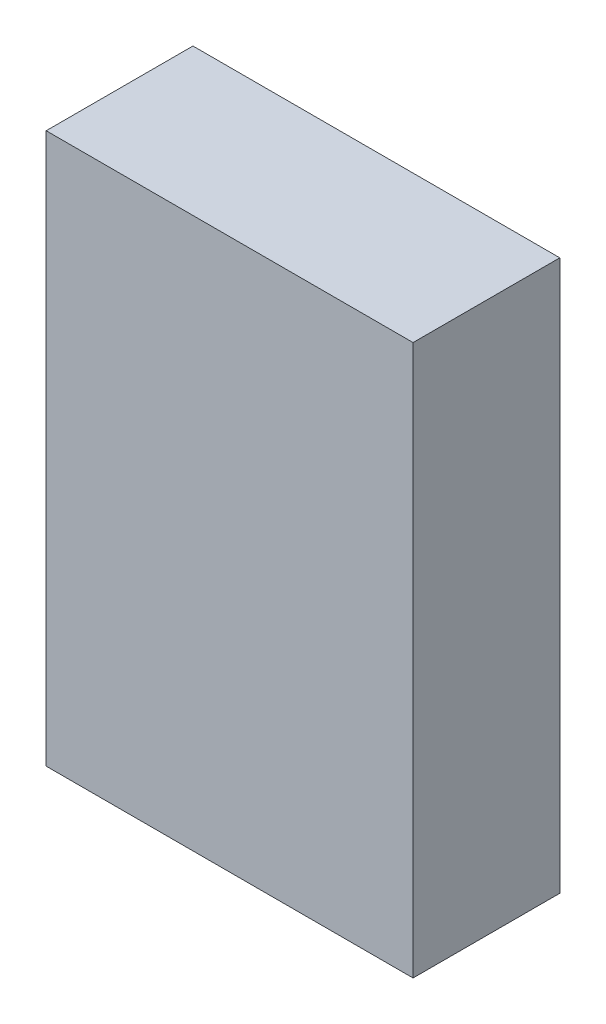
ISO-10303-21;
HEADER;
FILE_DESCRIPTION(('STEP AP214'),'2;1');
FILE_NAME('part.step','',(''),(''),'','','');
FILE_SCHEMA(('AUTOMOTIVE_DESIGN { 1 0 10303 214 1 1 1 1 }'));
ENDSEC;
DATA;
#1=APPLICATION_CONTEXT('core data for automotive mechanical design processes');
#2=APPLICATION_PROTOCOL_DEFINITION('international standard','automotive_design',2000,#1);
#3=PRODUCT_CONTEXT('',#1,'mechanical');
#4=PRODUCT('Part','Part','',(#3));
#5=PRODUCT_RELATED_PRODUCT_CATEGORY('part','',(#4));
#6=PRODUCT_DEFINITION_FORMATION('','',#4);
#7=PRODUCT_DEFINITION_CONTEXT('part definition',#1,'design');
#8=PRODUCT_DEFINITION('design','',#6,#7);
#9=PRODUCT_DEFINITION_SHAPE('','',#8);
#10=(LENGTH_UNIT() NAMED_UNIT(*) SI_UNIT(.MILLI.,.METRE.));
#11=(NAMED_UNIT(*) PLANE_ANGLE_UNIT() SI_UNIT($,.RADIAN.));
#12=(NAMED_UNIT(*) SI_UNIT($,.STERADIAN.) SOLID_ANGLE_UNIT());
#13=UNCERTAINTY_MEASURE_WITH_UNIT(LENGTH_MEASURE(1.E-05),#10,'distance_accuracy_value','');
#14=(GEOMETRIC_REPRESENTATION_CONTEXT(3) GLOBAL_UNCERTAINTY_ASSIGNED_CONTEXT((#13)) GLOBAL_UNIT_ASSIGNED_CONTEXT((#10,
#11,#12)) REPRESENTATION_CONTEXT('',''));
#15=CARTESIAN_POINT('',(0.,0.,0.));
#16=DIRECTION('',(0.,0.,1.));
#17=DIRECTION('',(1.,0.,0.));
#18=AXIS2_PLACEMENT_3D('',#15,#16,#17);
#19=CARTESIAN_POINT('',(-56.6260359487677,165.288343558282,80.));
#20=DIRECTION('',(1.,0.,0.));
#21=DIRECTION('',(0.,1.,0.));
#22=AXIS2_PLACEMENT_3D('',#19,#20,#21);
#23=PLANE('',#22);
#24=DIRECTION('',(0.,-1.,0.));
#25=VECTOR('',#24,1.);
#26=CARTESIAN_POINT('',(-56.6260359487677,165.288343558282,0.));
#27=LINE('',#26,#25);
#28=CARTESIAN_POINT('',(-56.6260359487677,165.288343558282,0.));
#29=VERTEX_POINT('',#28);
#30=CARTESIAN_POINT('',(-56.6260359487677,-134.711656441718,0.));
#31=VERTEX_POINT('',#30);
#32=EDGE_CURVE('E177',#29,#31,#27,.T.);
#33=ORIENTED_EDGE('',*,*,#32,.T.);
#34=DIRECTION('',(0.,0.,-1.));
#35=VECTOR('',#34,1.);
#36=CARTESIAN_POINT('',(-56.6260359487677,-134.711656441718,80.));
#37=LINE('',#36,#35);
#38=CARTESIAN_POINT('',(-56.6260359487677,-134.711656441718,80.));
#39=VERTEX_POINT('',#38);
#40=EDGE_CURVE('E221',#39,#31,#37,.T.);
#41=ORIENTED_EDGE('',*,*,#40,.F.);
#42=DIRECTION('',(0.,-1.,0.));
#43=VECTOR('',#42,1.);
#44=CARTESIAN_POINT('',(-56.6260359487677,165.288343558282,80.));
#45=LINE('',#44,#43);
#46=CARTESIAN_POINT('',(-56.6260359487677,165.288343558282,80.));
#47=VERTEX_POINT('',#46);
#48=EDGE_CURVE('E195',#47,#39,#45,.T.);
#49=ORIENTED_EDGE('',*,*,#48,.F.);
#50=DIRECTION('',(0.,0.,-1.));
#51=VECTOR('',#50,1.);
#52=CARTESIAN_POINT('',(-56.6260359487677,165.288343558282,80.));
#53=LINE('',#52,#51);
#54=EDGE_CURVE('E205',#47,#29,#53,.T.);
#55=ORIENTED_EDGE('',*,*,#54,.T.);
#56=EDGE_LOOP('',(#33,#41,#49,#55));
#57=FACE_BOUND('',#56,.T.);
#58=ADVANCED_FACE('F37',(#57),#23,.F.);
#59=CARTESIAN_POINT('',(-56.6260359487677,-134.711656441718,80.));
#60=DIRECTION('',(0.,1.,0.));
#61=DIRECTION('',(0.,0.,1.));
#62=AXIS2_PLACEMENT_3D('',#59,#60,#61);
#63=PLANE('',#62);
#64=DIRECTION('',(1.,0.,0.));
#65=VECTOR('',#64,1.);
#66=CARTESIAN_POINT('',(-56.6260359487677,-134.711656441718,0.));
#67=LINE('',#66,#65);
#68=CARTESIAN_POINT('',(143.373964051232,-134.711656441718,0.));
#69=VERTEX_POINT('',#68);
#70=EDGE_CURVE('E208',#31,#69,#67,.T.);
#71=ORIENTED_EDGE('',*,*,#70,.T.);
#72=DIRECTION('',(0.,0.,-1.));
#73=VECTOR('',#72,1.);
#74=CARTESIAN_POINT('',(143.373964051232,-134.711656441718,80.));
#75=LINE('',#74,#73);
#76=CARTESIAN_POINT('',(143.373964051232,-134.711656441718,80.));
#77=VERTEX_POINT('',#76);
#78=EDGE_CURVE('E218',#77,#69,#75,.T.);
#79=ORIENTED_EDGE('',*,*,#78,.F.);
#80=DIRECTION('',(1.,0.,0.));
#81=VECTOR('',#80,1.);
#82=CARTESIAN_POINT('',(-56.6260359487677,-134.711656441718,80.));
#83=LINE('',#82,#81);
#84=EDGE_CURVE('E198',#39,#77,#83,.T.);
#85=ORIENTED_EDGE('',*,*,#84,.F.);
#86=ORIENTED_EDGE('',*,*,#40,.T.);
#87=EDGE_LOOP('',(#71,#79,#85,#86));
#88=FACE_BOUND('',#87,.T.);
#89=ADVANCED_FACE('F287',(#88),#63,.F.);
#90=CARTESIAN_POINT('',(143.373964051232,165.288343558282,80.));
#91=DIRECTION('',(-1.,0.,0.));
#92=DIRECTION('',(0.,-1.,0.));
#93=AXIS2_PLACEMENT_3D('',#90,#91,#92);
#94=PLANE('',#93);
#95=DIRECTION('',(0.,1.,0.));
#96=VECTOR('',#95,1.);
#97=CARTESIAN_POINT('',(143.373964051232,165.288343558282,0.));
#98=LINE('',#97,#96);
#99=CARTESIAN_POINT('',(143.373964051232,165.288343558282,0.));
#100=VERTEX_POINT('',#99);
#101=EDGE_CURVE('E210',#69,#100,#98,.T.);
#102=ORIENTED_EDGE('',*,*,#101,.T.);
#103=DIRECTION('',(0.,0.,-1.));
#104=VECTOR('',#103,1.);
#105=CARTESIAN_POINT('',(143.373964051232,165.288343558282,80.));
#106=LINE('',#105,#104);
#107=CARTESIAN_POINT('',(143.373964051232,165.288343558282,80.));
#108=VERTEX_POINT('',#107);
#109=EDGE_CURVE('E215',#108,#100,#106,.T.);
#110=ORIENTED_EDGE('',*,*,#109,.F.);
#111=DIRECTION('',(0.,1.,0.));
#112=VECTOR('',#111,1.);
#113=CARTESIAN_POINT('',(143.373964051232,165.288343558282,80.));
#114=LINE('',#113,#112);
#115=EDGE_CURVE('E201',#77,#108,#114,.T.);
#116=ORIENTED_EDGE('',*,*,#115,.F.);
#117=ORIENTED_EDGE('',*,*,#78,.T.);
#118=EDGE_LOOP('',(#102,#110,#116,#117));
#119=FACE_BOUND('',#118,.T.);
#120=ADVANCED_FACE('F292',(#119),#94,.F.);
#121=CARTESIAN_POINT('',(-56.6260359487677,165.288343558282,80.));
#122=DIRECTION('',(0.,-1.,0.));
#123=DIRECTION('',(0.,0.,-1.));
#124=AXIS2_PLACEMENT_3D('',#121,#122,#123);
#125=PLANE('',#124);
#126=DIRECTION('',(-1.,0.,0.));
#127=VECTOR('',#126,1.);
#128=CARTESIAN_POINT('',(-56.6260359487677,165.288343558282,0.));
#129=LINE('',#128,#127);
#130=EDGE_CURVE('E199',#100,#29,#129,.T.);
#131=ORIENTED_EDGE('',*,*,#130,.T.);
#132=ORIENTED_EDGE('',*,*,#54,.F.);
#133=DIRECTION('',(-1.,0.,0.));
#134=VECTOR('',#133,1.);
#135=CARTESIAN_POINT('',(-56.6260359487677,165.288343558282,80.));
#136=LINE('',#135,#134);
#137=EDGE_CURVE('E203',#108,#47,#136,.T.);
#138=ORIENTED_EDGE('',*,*,#137,.F.);
#139=ORIENTED_EDGE('',*,*,#109,.T.);
#140=EDGE_LOOP('',(#131,#132,#138,#139));
#141=FACE_BOUND('',#140,.T.);
#142=ADVANCED_FACE('F309',(#141),#125,.F.);
#143=CARTESIAN_POINT('',(0.,134.,80.));
#144=DIRECTION('',(0.,0.,1.));
#145=DIRECTION('',(1.,0.,0.));
#146=AXIS2_PLACEMENT_3D('',#143,#144,#145);
#147=PLANE('',#146);
#148=ORIENTED_EDGE('',*,*,#48,.T.);
#149=ORIENTED_EDGE('',*,*,#84,.T.);
#150=ORIENTED_EDGE('',*,*,#115,.T.);
#151=ORIENTED_EDGE('',*,*,#137,.T.);
#152=EDGE_LOOP('',(#148,#149,#150,#151));
#153=FACE_BOUND('',#152,.T.);
#154=ADVANCED_FACE('F305',(#153),#147,.T.);
#155=CARTESIAN_POINT('',(0.,134.,0.));
#156=DIRECTION('',(0.,0.,1.));
#157=DIRECTION('',(1.,0.,0.));
#158=AXIS2_PLACEMENT_3D('',#155,#156,#157);
#159=PLANE('',#158);
#160=DIRECTION('',(0.,1.,0.));
#161=VECTOR('',#160,1.);
#162=CARTESIAN_POINT('',(-53.7260359487677,-131.811656441718,0.));
#163=LINE('',#162,#161);
#164=CARTESIAN_POINT('',(-53.7260359487677,-131.811656441718,0.));
#165=VERTEX_POINT('',#164);
#166=CARTESIAN_POINT('',(-53.7260359487677,162.388343558282,0.));
#167=VERTEX_POINT('',#166);
#168=EDGE_CURVE('E157',#165,#167,#163,.T.);
#169=ORIENTED_EDGE('',*,*,#168,.F.);
#170=DIRECTION('',(-1.,0.,0.));
#171=VECTOR('',#170,1.);
#172=CARTESIAN_POINT('',(140.473964051232,-131.811656441718,0.));
#173=LINE('',#172,#171);
#174=CARTESIAN_POINT('',(140.473964051232,-131.811656441718,0.));
#175=VERTEX_POINT('',#174);
#176=EDGE_CURVE('E51',#175,#165,#173,.T.);
#177=ORIENTED_EDGE('',*,*,#176,.F.);
#178=DIRECTION('',(0.,-1.,0.));
#179=VECTOR('',#178,1.);
#180=CARTESIAN_POINT('',(140.473964051232,162.388343558282,0.));
#181=LINE('',#180,#179);
#182=CARTESIAN_POINT('',(140.473964051232,162.388343558282,0.));
#183=VERTEX_POINT('',#182);
#184=EDGE_CURVE('E145',#183,#175,#181,.T.);
#185=ORIENTED_EDGE('',*,*,#184,.F.);
#186=DIRECTION('',(1.,0.,0.));
#187=VECTOR('',#186,1.);
#188=CARTESIAN_POINT('',(-53.7260359487677,162.388343558282,0.));
#189=LINE('',#188,#187);
#190=EDGE_CURVE('E148',#167,#183,#189,.T.);
#191=ORIENTED_EDGE('',*,*,#190,.F.);
#192=EDGE_LOOP('',(#169,#177,#185,#191));
#193=FACE_BOUND('',#192,.T.);
#194=ORIENTED_EDGE('',*,*,#32,.F.);
#195=ORIENTED_EDGE('',*,*,#130,.F.);
#196=ORIENTED_EDGE('',*,*,#101,.F.);
#197=ORIENTED_EDGE('',*,*,#70,.F.);
#198=EDGE_LOOP('',(#194,#195,#196,#197));
#199=FACE_BOUND('',#198,.T.);
#200=ADVANCED_FACE('F300',(#193,#199),#159,.F.);
#201=CARTESIAN_POINT('',(140.473964051232,-131.811656441718,6.1));
#202=DIRECTION('',(0.,-1.,0.));
#203=DIRECTION('',(0.,0.,-1.));
#204=AXIS2_PLACEMENT_3D('',#201,#202,#203);
#205=PLANE('',#204);
#206=ORIENTED_EDGE('',*,*,#176,.T.);
#207=DIRECTION('',(0.,0.,-1.));
#208=VECTOR('',#207,1.);
#209=CARTESIAN_POINT('',(-53.7260359487677,-131.811656441718,6.1));
#210=LINE('',#209,#208);
#211=CARTESIAN_POINT('',(-53.7260359487677,-131.811656441718,6.1));
#212=VERTEX_POINT('',#211);
#213=EDGE_CURVE('E123',#212,#165,#210,.T.);
#214=ORIENTED_EDGE('',*,*,#213,.F.);
#215=DIRECTION('',(-1.,0.,0.));
#216=VECTOR('',#215,1.);
#217=CARTESIAN_POINT('',(140.473964051232,-131.811656441718,6.1));
#218=LINE('',#217,#216);
#219=CARTESIAN_POINT('',(140.473964051232,-131.811656441718,6.1));
#220=VERTEX_POINT('',#219);
#221=EDGE_CURVE('E127',#220,#212,#218,.T.);
#222=ORIENTED_EDGE('',*,*,#221,.F.);
#223=DIRECTION('',(0.,0.,-1.));
#224=VECTOR('',#223,1.);
#225=CARTESIAN_POINT('',(140.473964051232,-131.811656441718,6.1));
#226=LINE('',#225,#224);
#227=EDGE_CURVE('E161',#220,#175,#226,.T.);
#228=ORIENTED_EDGE('',*,*,#227,.T.);
#229=EDGE_LOOP('',(#206,#214,#222,#228));
#230=FACE_BOUND('',#229,.T.);
#231=ADVANCED_FACE('F125',(#230),#205,.F.);
#232=CARTESIAN_POINT('',(140.473964051232,162.388343558282,6.1));
#233=DIRECTION('',(1.,0.,0.));
#234=DIRECTION('',(0.,1.,0.));
#235=AXIS2_PLACEMENT_3D('',#232,#233,#234);
#236=PLANE('',#235);
#237=ORIENTED_EDGE('',*,*,#184,.T.);
#238=ORIENTED_EDGE('',*,*,#227,.F.);
#239=DIRECTION('',(0.,-1.,0.));
#240=VECTOR('',#239,1.);
#241=CARTESIAN_POINT('',(140.473964051232,162.388343558282,6.1));
#242=LINE('',#241,#240);
#243=CARTESIAN_POINT('',(140.473964051232,162.388343558282,6.1));
#244=VERTEX_POINT('',#243);
#245=EDGE_CURVE('E133',#244,#220,#242,.T.);
#246=ORIENTED_EDGE('',*,*,#245,.F.);
#247=DIRECTION('',(0.,0.,-1.));
#248=VECTOR('',#247,1.);
#249=CARTESIAN_POINT('',(140.473964051232,162.388343558282,6.1));
#250=LINE('',#249,#248);
#251=EDGE_CURVE('E163',#244,#183,#250,.T.);
#252=ORIENTED_EDGE('',*,*,#251,.T.);
#253=EDGE_LOOP('',(#237,#238,#246,#252));
#254=FACE_BOUND('',#253,.T.);
#255=ADVANCED_FACE('F339',(#254),#236,.F.);
#256=CARTESIAN_POINT('',(-53.7260359487677,162.388343558282,6.1));
#257=DIRECTION('',(0.,1.,0.));
#258=DIRECTION('',(0.,0.,1.));
#259=AXIS2_PLACEMENT_3D('',#256,#257,#258);
#260=PLANE('',#259);
#261=ORIENTED_EDGE('',*,*,#190,.T.);
#262=ORIENTED_EDGE('',*,*,#251,.F.);
#263=DIRECTION('',(1.,0.,0.));
#264=VECTOR('',#263,1.);
#265=CARTESIAN_POINT('',(-53.7260359487677,162.388343558282,6.1));
#266=LINE('',#265,#264);
#267=CARTESIAN_POINT('',(-53.7260359487677,162.388343558282,6.1));
#268=VERTEX_POINT('',#267);
#269=EDGE_CURVE('E141',#268,#244,#266,.T.);
#270=ORIENTED_EDGE('',*,*,#269,.F.);
#271=DIRECTION('',(0.,0.,-1.));
#272=VECTOR('',#271,1.);
#273=CARTESIAN_POINT('',(-53.7260359487677,162.388343558282,6.1));
#274=LINE('',#273,#272);
#275=EDGE_CURVE('E132',#268,#167,#274,.T.);
#276=ORIENTED_EDGE('',*,*,#275,.T.);
#277=EDGE_LOOP('',(#261,#262,#270,#276));
#278=FACE_BOUND('',#277,.T.);
#279=ADVANCED_FACE('F349',(#278),#260,.F.);
#280=CARTESIAN_POINT('',(-53.7260359487677,-131.811656441718,6.1));
#281=DIRECTION('',(-1.,0.,0.));
#282=DIRECTION('',(0.,-1.,0.));
#283=AXIS2_PLACEMENT_3D('',#280,#281,#282);
#284=PLANE('',#283);
#285=ORIENTED_EDGE('',*,*,#168,.T.);
#286=ORIENTED_EDGE('',*,*,#275,.F.);
#287=DIRECTION('',(0.,1.,0.));
#288=VECTOR('',#287,1.);
#289=CARTESIAN_POINT('',(-53.7260359487677,-131.811656441718,6.1));
#290=LINE('',#289,#288);
#291=EDGE_CURVE('E136',#212,#268,#290,.T.);
#292=ORIENTED_EDGE('',*,*,#291,.F.);
#293=ORIENTED_EDGE('',*,*,#213,.T.);
#294=EDGE_LOOP('',(#285,#286,#292,#293));
#295=FACE_BOUND('',#294,.T.);
#296=ADVANCED_FACE('F137',(#295),#284,.F.);
#297=CARTESIAN_POINT('',(0.,134.,6.1));
#298=DIRECTION('',(0.,0.,-1.));
#299=DIRECTION('',(-1.,0.,0.));
#300=AXIS2_PLACEMENT_3D('',#297,#298,#299);
#301=PLANE('',#300);
#302=DIRECTION('',(-1.,0.,0.));
#303=VECTOR('',#302,1.);
#304=CARTESIAN_POINT('',(-56.6260359487677,-128.711656441718,6.09999999999999));
#305=LINE('',#304,#303);
#306=CARTESIAN_POINT('',(137.373964051232,-128.711656441718,6.09999999999999));
#307=VERTEX_POINT('',#306);
#308=CARTESIAN_POINT('',(-50.6260359487677,-128.711656441718,6.09999999999999));
#309=VERTEX_POINT('',#308);
#310=EDGE_CURVE('E167',#307,#309,#305,.T.);
#311=ORIENTED_EDGE('',*,*,#310,.F.);
#312=DIRECTION('',(0.,-1.,0.));
#313=VECTOR('',#312,1.);
#314=CARTESIAN_POINT('',(137.373964051232,165.288343558282,6.09999999999999));
#315=LINE('',#314,#313);
#316=CARTESIAN_POINT('',(137.373964051232,159.288343558282,6.09999999999999));
#317=VERTEX_POINT('',#316);
#318=EDGE_CURVE('E59',#317,#307,#315,.T.);
#319=ORIENTED_EDGE('',*,*,#318,.F.);
#320=DIRECTION('',(1.,0.,0.));
#321=VECTOR('',#320,1.);
#322=CARTESIAN_POINT('',(-56.6260359487677,159.288343558282,6.09999999999999));
#323=LINE('',#322,#321);
#324=CARTESIAN_POINT('',(-50.6260359487677,159.288343558282,6.09999999999999));
#325=VERTEX_POINT('',#324);
#326=EDGE_CURVE('E224',#325,#317,#323,.T.);
#327=ORIENTED_EDGE('',*,*,#326,.F.);
#328=DIRECTION('',(0.,1.,0.));
#329=VECTOR('',#328,1.);
#330=CARTESIAN_POINT('',(-50.6260359487677,165.288343558282,6.09999999999999));
#331=LINE('',#330,#329);
#332=EDGE_CURVE('E170',#309,#325,#331,.T.);
#333=ORIENTED_EDGE('',*,*,#332,.F.);
#334=EDGE_LOOP('',(#311,#319,#327,#333));
#335=FACE_BOUND('',#334,.T.);
#336=ORIENTED_EDGE('',*,*,#221,.T.);
#337=ORIENTED_EDGE('',*,*,#291,.T.);
#338=ORIENTED_EDGE('',*,*,#269,.T.);
#339=ORIENTED_EDGE('',*,*,#245,.T.);
#340=EDGE_LOOP('',(#336,#337,#338,#339));
#341=FACE_BOUND('',#340,.T.);
#342=ADVANCED_FACE('F143',(#335,#341),#301,.T.);
#343=CARTESIAN_POINT('',(0.,134.,74.));
#344=DIRECTION('',(0.,0.,1.));
#345=DIRECTION('',(1.,0.,0.));
#346=AXIS2_PLACEMENT_3D('',#343,#344,#345);
#347=PLANE('',#346);
#348=CARTESIAN_POINT('',(117.373964051232,-108.711656441718,74.));
#349=DIRECTION('',(0.,0.,1.));
#350=DIRECTION('',(1.,0.,0.));
#351=AXIS2_PLACEMENT_3D('',#348,#349,#350);
#352=CIRCLE('',#351,9.00000000000001);
#353=CARTESIAN_POINT('',(126.373964051232,-108.711656441718,74.));
#354=VERTEX_POINT('',#353);
#355=EDGE_CURVE('E11',#354,#354,#352,.F.);
#356=ORIENTED_EDGE('',*,*,#355,.F.);
#357=EDGE_LOOP('',(#356));
#358=FACE_BOUND('',#357,.T.);
#359=CARTESIAN_POINT('',(-30.6260359487677,-108.711656441718,74.));
#360=DIRECTION('',(0.,0.,1.));
#361=DIRECTION('',(1.,0.,0.));
#362=AXIS2_PLACEMENT_3D('',#359,#360,#361);
#363=CIRCLE('',#362,9.00000000000001);
#364=CARTESIAN_POINT('',(-21.6260359487677,-108.711656441718,74.));
#365=VERTEX_POINT('',#364);
#366=EDGE_CURVE('E44',#365,#365,#363,.F.);
#367=ORIENTED_EDGE('',*,*,#366,.F.);
#368=EDGE_LOOP('',(#367));
#369=FACE_BOUND('',#368,.T.);
#370=CARTESIAN_POINT('',(-30.6260359487677,139.288343558282,74.));
#371=DIRECTION('',(0.,0.,1.));
#372=DIRECTION('',(1.,0.,0.));
#373=AXIS2_PLACEMENT_3D('',#370,#371,#372);
#374=CIRCLE('',#373,9.);
#375=CARTESIAN_POINT('',(-21.6260359487677,139.288343558282,74.));
#376=VERTEX_POINT('',#375);
#377=EDGE_CURVE('E241',#376,#376,#374,.F.);
#378=ORIENTED_EDGE('',*,*,#377,.F.);
#379=EDGE_LOOP('',(#378));
#380=FACE_BOUND('',#379,.T.);
#381=CARTESIAN_POINT('',(99.8739640512324,-49.7116564417177,74.));
#382=DIRECTION('',(0.,0.,1.));
#383=DIRECTION('',(1.,0.,0.));
#384=AXIS2_PLACEMENT_3D('',#381,#382,#383);
#385=CIRCLE('',#384,9.00000000000001);
#386=CARTESIAN_POINT('',(108.873964051232,-49.7116564417177,74.));
#387=VERTEX_POINT('',#386);
#388=EDGE_CURVE('E238',#387,#387,#385,.F.);
#389=ORIENTED_EDGE('',*,*,#388,.F.);
#390=EDGE_LOOP('',(#389));
#391=FACE_BOUND('',#390,.T.);
#392=CARTESIAN_POINT('',(-13.1260359487677,80.2883435582823,74.));
#393=DIRECTION('',(0.,0.,1.));
#394=DIRECTION('',(1.,0.,0.));
#395=AXIS2_PLACEMENT_3D('',#392,#393,#394);
#396=CIRCLE('',#395,9.00000000000001);
#397=CARTESIAN_POINT('',(-4.12603594876768,80.2883435582823,74.));
#398=VERTEX_POINT('',#397);
#399=EDGE_CURVE('E235',#398,#398,#396,.F.);
#400=ORIENTED_EDGE('',*,*,#399,.F.);
#401=EDGE_LOOP('',(#400));
#402=FACE_BOUND('',#401,.T.);
#403=CARTESIAN_POINT('',(-13.1260359487677,-49.7116564417177,74.));
#404=DIRECTION('',(0.,0.,1.));
#405=DIRECTION('',(1.,0.,0.));
#406=AXIS2_PLACEMENT_3D('',#403,#404,#405);
#407=CIRCLE('',#406,9.00000000000001);
#408=CARTESIAN_POINT('',(-4.12603594876767,-49.7116564417177,74.));
#409=VERTEX_POINT('',#408);
#410=EDGE_CURVE('E232',#409,#409,#407,.F.);
#411=ORIENTED_EDGE('',*,*,#410,.F.);
#412=EDGE_LOOP('',(#411));
#413=FACE_BOUND('',#412,.T.);
#414=CARTESIAN_POINT('',(99.8739640512324,80.2883435582823,74.));
#415=DIRECTION('',(0.,0.,1.));
#416=DIRECTION('',(1.,0.,0.));
#417=AXIS2_PLACEMENT_3D('',#414,#415,#416);
#418=CIRCLE('',#417,9.00000000000001);
#419=CARTESIAN_POINT('',(108.873964051232,80.2883435582823,74.));
#420=VERTEX_POINT('',#419);
#421=EDGE_CURVE('E229',#420,#420,#418,.F.);
#422=ORIENTED_EDGE('',*,*,#421,.F.);
#423=EDGE_LOOP('',(#422));
#424=FACE_BOUND('',#423,.T.);
#425=CARTESIAN_POINT('',(117.373964051232,139.288343558282,74.));
#426=DIRECTION('',(0.,0.,1.));
#427=DIRECTION('',(1.,0.,0.));
#428=AXIS2_PLACEMENT_3D('',#425,#426,#427);
#429=CIRCLE('',#428,9.00000000000001);
#430=CARTESIAN_POINT('',(126.373964051232,139.288343558282,74.));
#431=VERTEX_POINT('',#430);
#432=EDGE_CURVE('E226',#431,#431,#429,.F.);
#433=ORIENTED_EDGE('',*,*,#432,.F.);
#434=EDGE_LOOP('',(#433));
#435=FACE_BOUND('',#434,.T.);
#436=DIRECTION('',(0.,-1.,0.));
#437=VECTOR('',#436,1.);
#438=CARTESIAN_POINT('',(-50.6260359487677,165.288343558282,74.));
#439=LINE('',#438,#437);
#440=CARTESIAN_POINT('',(-50.6260359487677,159.288343558282,74.));
#441=VERTEX_POINT('',#440);
#442=CARTESIAN_POINT('',(-50.6260359487677,-128.711656441718,74.));
#443=VERTEX_POINT('',#442);
#444=EDGE_CURVE('E173',#441,#443,#439,.T.);
#445=ORIENTED_EDGE('',*,*,#444,.F.);
#446=DIRECTION('',(-1.,0.,0.));
#447=VECTOR('',#446,1.);
#448=CARTESIAN_POINT('',(-56.6260359487677,159.288343558282,74.));
#449=LINE('',#448,#447);
#450=CARTESIAN_POINT('',(137.373964051232,159.288343558282,74.));
#451=VERTEX_POINT('',#450);
#452=EDGE_CURVE('E186',#451,#441,#449,.T.);
#453=ORIENTED_EDGE('',*,*,#452,.F.);
#454=DIRECTION('',(0.,1.,0.));
#455=VECTOR('',#454,1.);
#456=CARTESIAN_POINT('',(137.373964051232,165.288343558282,74.));
#457=LINE('',#456,#455);
#458=CARTESIAN_POINT('',(137.373964051232,-128.711656441718,74.));
#459=VERTEX_POINT('',#458);
#460=EDGE_CURVE('E190',#459,#451,#457,.T.);
#461=ORIENTED_EDGE('',*,*,#460,.F.);
#462=DIRECTION('',(1.,0.,0.));
#463=VECTOR('',#462,1.);
#464=CARTESIAN_POINT('',(-56.6260359487677,-128.711656441718,74.));
#465=LINE('',#464,#463);
#466=EDGE_CURVE('E181',#443,#459,#465,.T.);
#467=ORIENTED_EDGE('',*,*,#466,.F.);
#468=EDGE_LOOP('',(#445,#453,#461,#467));
#469=FACE_BOUND('',#468,.T.);
#470=ADVANCED_FACE('F248',(#358,#369,#380,#391,#402,#413,#424,#435,#469),#347,.F.);
#471=CARTESIAN_POINT('',(-56.6260359487677,159.288343558282,80.));
#472=DIRECTION('',(0.,-1.,0.));
#473=DIRECTION('',(0.,0.,-1.));
#474=AXIS2_PLACEMENT_3D('',#471,#472,#473);
#475=PLANE('',#474);
#476=DIRECTION('',(0.,0.,-1.));
#477=VECTOR('',#476,1.);
#478=CARTESIAN_POINT('',(-50.6260359487677,159.288343558282,80.));
#479=LINE('',#478,#477);
#480=EDGE_CURVE('E182',#441,#325,#479,.T.);
#481=ORIENTED_EDGE('',*,*,#480,.T.);
#482=ORIENTED_EDGE('',*,*,#326,.T.);
#483=DIRECTION('',(0.,0.,-1.));
#484=VECTOR('',#483,1.);
#485=CARTESIAN_POINT('',(137.373964051232,159.288343558282,80.));
#486=LINE('',#485,#484);
#487=EDGE_CURVE('E185',#451,#317,#486,.T.);
#488=ORIENTED_EDGE('',*,*,#487,.F.);
#489=ORIENTED_EDGE('',*,*,#452,.T.);
#490=EDGE_LOOP('',(#481,#482,#488,#489));
#491=FACE_BOUND('',#490,.T.);
#492=ADVANCED_FACE('F251',(#491),#475,.T.);
#493=CARTESIAN_POINT('',(137.373964051232,165.288343558282,80.));
#494=DIRECTION('',(-1.,0.,0.));
#495=DIRECTION('',(0.,-1.,0.));
#496=AXIS2_PLACEMENT_3D('',#493,#494,#495);
#497=PLANE('',#496);
#498=ORIENTED_EDGE('',*,*,#487,.T.);
#499=ORIENTED_EDGE('',*,*,#318,.T.);
#500=DIRECTION('',(0.,0.,-1.));
#501=VECTOR('',#500,1.);
#502=CARTESIAN_POINT('',(137.373964051232,-128.711656441718,80.));
#503=LINE('',#502,#501);
#504=EDGE_CURVE('E178',#459,#307,#503,.T.);
#505=ORIENTED_EDGE('',*,*,#504,.F.);
#506=ORIENTED_EDGE('',*,*,#460,.T.);
#507=EDGE_LOOP('',(#498,#499,#505,#506));
#508=FACE_BOUND('',#507,.T.);
#509=ADVANCED_FACE('F277',(#508),#497,.T.);
#510=CARTESIAN_POINT('',(-56.6260359487677,-128.711656441718,80.));
#511=DIRECTION('',(0.,1.,0.));
#512=DIRECTION('',(0.,0.,1.));
#513=AXIS2_PLACEMENT_3D('',#510,#511,#512);
#514=PLANE('',#513);
#515=ORIENTED_EDGE('',*,*,#504,.T.);
#516=ORIENTED_EDGE('',*,*,#310,.T.);
#517=DIRECTION('',(0.,0.,-1.));
#518=VECTOR('',#517,1.);
#519=CARTESIAN_POINT('',(-50.6260359487677,-128.711656441718,80.));
#520=LINE('',#519,#518);
#521=EDGE_CURVE('E174',#443,#309,#520,.T.);
#522=ORIENTED_EDGE('',*,*,#521,.F.);
#523=ORIENTED_EDGE('',*,*,#466,.T.);
#524=EDGE_LOOP('',(#515,#516,#522,#523));
#525=FACE_BOUND('',#524,.T.);
#526=ADVANCED_FACE('F274',(#525),#514,.T.);
#527=CARTESIAN_POINT('',(-50.6260359487677,165.288343558282,80.));
#528=DIRECTION('',(1.,0.,0.));
#529=DIRECTION('',(0.,1.,0.));
#530=AXIS2_PLACEMENT_3D('',#527,#528,#529);
#531=PLANE('',#530);
#532=ORIENTED_EDGE('',*,*,#521,.T.);
#533=ORIENTED_EDGE('',*,*,#332,.T.);
#534=ORIENTED_EDGE('',*,*,#480,.F.);
#535=ORIENTED_EDGE('',*,*,#444,.T.);
#536=EDGE_LOOP('',(#532,#533,#534,#535));
#537=FACE_BOUND('',#536,.T.);
#538=ADVANCED_FACE('F272',(#537),#531,.T.);
#539=CARTESIAN_POINT('',(117.373964051232,139.288343558282,6.09999999999999));
#540=DIRECTION('',(0.,0.,1.));
#541=DIRECTION('',(1.,0.,0.));
#542=AXIS2_PLACEMENT_3D('',#539,#540,#541);
#543=CYLINDRICAL_SURFACE('',#542,9.00000000000001);
#544=CARTESIAN_POINT('',(117.373964051232,139.288343558282,6.09999999999999));
#545=DIRECTION('',(0.,0.,-1.));
#546=DIRECTION('',(-1.,0.,0.));
#547=AXIS2_PLACEMENT_3D('',#544,#545,#546);
#548=CIRCLE('',#547,9.00000000000001);
#549=CARTESIAN_POINT('',(108.373964051232,139.288343558282,6.09999999999999));
#550=VERTEX_POINT('',#549);
#551=EDGE_CURVE('E151',#550,#550,#548,.T.);
#552=ORIENTED_EDGE('',*,*,#551,.F.);
#553=EDGE_LOOP('',(#552));
#554=FACE_BOUND('',#553,.T.);
#555=ORIENTED_EDGE('',*,*,#432,.T.);
#556=EDGE_LOOP('',(#555));
#557=FACE_BOUND('',#556,.T.);
#558=ADVANCED_FACE('F427',(#554,#557),#543,.T.);
#559=CARTESIAN_POINT('',(117.373964051232,139.288343558282,6.09999999999999));
#560=DIRECTION('',(0.,0.,-1.));
#561=DIRECTION('',(-1.,0.,0.));
#562=AXIS2_PLACEMENT_3D('',#559,#560,#561);
#563=PLANE('',#562);
#564=CARTESIAN_POINT('',(117.373964051232,139.288343558282,6.09999999999999));
#565=DIRECTION('',(0.,0.,-1.));
#566=DIRECTION('',(-1.,0.,0.));
#567=AXIS2_PLACEMENT_3D('',#564,#565,#566);
#568=CIRCLE('',#567,2.50000000000001);
#569=CARTESIAN_POINT('',(114.873964051232,139.288343558282,6.09999999999999));
#570=VERTEX_POINT('',#569);
#571=EDGE_CURVE('E807',#570,#570,#568,.T.);
#572=ORIENTED_EDGE('',*,*,#571,.F.);
#573=EDGE_LOOP('',(#572));
#574=FACE_BOUND('',#573,.T.);
#575=ORIENTED_EDGE('',*,*,#551,.T.);
#576=EDGE_LOOP('',(#575));
#577=FACE_BOUND('',#576,.T.);
#578=ADVANCED_FACE('F434',(#574,#577),#563,.T.);
#579=CARTESIAN_POINT('',(117.373964051232,139.288343558282,36.1));
#580=DIRECTION('',(0.,0.,-1.));
#581=DIRECTION('',(-1.,0.,0.));
#582=AXIS2_PLACEMENT_3D('',#579,#580,#581);
#583=CYLINDRICAL_SURFACE('',#582,2.50000000000001);
#584=CARTESIAN_POINT('',(117.373964051232,139.288343558282,36.1));
#585=DIRECTION('',(0.,0.,-1.));
#586=DIRECTION('',(-1.,0.,0.));
#587=AXIS2_PLACEMENT_3D('',#584,#585,#586);
#588=CIRCLE('',#587,2.50000000000001);
#589=CARTESIAN_POINT('',(114.873964051232,139.288343558282,36.1));
#590=VERTEX_POINT('',#589);
#591=EDGE_CURVE('E808',#590,#590,#588,.T.);
#592=ORIENTED_EDGE('',*,*,#591,.F.);
#593=EDGE_LOOP('',(#592));
#594=FACE_BOUND('',#593,.T.);
#595=ORIENTED_EDGE('',*,*,#571,.T.);
#596=EDGE_LOOP('',(#595));
#597=FACE_BOUND('',#596,.T.);
#598=ADVANCED_FACE('F444',(#594,#597),#583,.F.);
#599=CARTESIAN_POINT('',(117.373964051232,139.288343558282,36.1));
#600=DIRECTION('',(0.,0.,-1.));
#601=DIRECTION('',(-1.,0.,0.));
#602=AXIS2_PLACEMENT_3D('',#599,#600,#601);
#603=PLANE('',#602);
#604=ORIENTED_EDGE('',*,*,#591,.T.);
#605=EDGE_LOOP('',(#604));
#606=FACE_BOUND('',#605,.T.);
#607=ADVANCED_FACE('F454',(#606),#603,.T.);
#608=CARTESIAN_POINT('',(99.8739640512324,80.2883435582823,59.));
#609=DIRECTION('',(0.,0.,1.));
#610=DIRECTION('',(1.,0.,0.));
#611=AXIS2_PLACEMENT_3D('',#608,#609,#610);
#612=CYLINDRICAL_SURFACE('',#611,9.00000000000001);
#613=CARTESIAN_POINT('',(99.8739640512324,80.2883435582823,59.));
#614=DIRECTION('',(0.,0.,-1.));
#615=DIRECTION('',(-1.,0.,0.));
#616=AXIS2_PLACEMENT_3D('',#613,#614,#615);
#617=CIRCLE('',#616,9.00000000000001);
#618=CARTESIAN_POINT('',(90.8739640512323,80.2883435582823,59.));
#619=VERTEX_POINT('',#618);
#620=EDGE_CURVE('E804',#619,#619,#617,.T.);
#621=ORIENTED_EDGE('',*,*,#620,.F.);
#622=EDGE_LOOP('',(#621));
#623=FACE_BOUND('',#622,.T.);
#624=ORIENTED_EDGE('',*,*,#421,.T.);
#625=EDGE_LOOP('',(#624));
#626=FACE_BOUND('',#625,.T.);
#627=ADVANCED_FACE('F464',(#623,#626),#612,.T.);
#628=CARTESIAN_POINT('',(0.,134.,59.));
#629=DIRECTION('',(0.,0.,-1.));
#630=DIRECTION('',(-1.,0.,0.));
#631=AXIS2_PLACEMENT_3D('',#628,#629,#630);
#632=PLANE('',#631);
#633=CARTESIAN_POINT('',(99.8739640512324,80.2883435582823,59.));
#634=DIRECTION('',(0.,0.,-1.));
#635=DIRECTION('',(-1.,0.,0.));
#636=AXIS2_PLACEMENT_3D('',#633,#634,#635);
#637=CIRCLE('',#636,2.5);
#638=CARTESIAN_POINT('',(97.3739640512324,80.2883435582823,59.));
#639=VERTEX_POINT('',#638);
#640=EDGE_CURVE('E781',#639,#639,#637,.T.);
#641=ORIENTED_EDGE('',*,*,#640,.F.);
#642=EDGE_LOOP('',(#641));
#643=FACE_BOUND('',#642,.T.);
#644=ORIENTED_EDGE('',*,*,#620,.T.);
#645=EDGE_LOOP('',(#644));
#646=FACE_BOUND('',#645,.T.);
#647=ADVANCED_FACE('F474',(#643,#646),#632,.T.);
#648=CARTESIAN_POINT('',(-13.1260359487677,-49.7116564417177,59.));
#649=DIRECTION('',(0.,0.,1.));
#650=DIRECTION('',(1.,0.,0.));
#651=AXIS2_PLACEMENT_3D('',#648,#649,#650);
#652=CYLINDRICAL_SURFACE('',#651,9.00000000000001);
#653=CARTESIAN_POINT('',(-13.1260359487677,-49.7116564417177,59.));
#654=DIRECTION('',(0.,0.,-1.));
#655=DIRECTION('',(-1.,0.,0.));
#656=AXIS2_PLACEMENT_3D('',#653,#654,#655);
#657=CIRCLE('',#656,9.00000000000001);
#658=CARTESIAN_POINT('',(-22.1260359487677,-49.7116564417177,59.));
#659=VERTEX_POINT('',#658);
#660=EDGE_CURVE('E801',#659,#659,#657,.T.);
#661=ORIENTED_EDGE('',*,*,#660,.F.);
#662=EDGE_LOOP('',(#661));
#663=FACE_BOUND('',#662,.T.);
#664=ORIENTED_EDGE('',*,*,#410,.T.);
#665=EDGE_LOOP('',(#664));
#666=FACE_BOUND('',#665,.T.);
#667=ADVANCED_FACE('F485',(#663,#666),#652,.T.);
#668=CARTESIAN_POINT('',(0.,134.,59.));
#669=DIRECTION('',(0.,0.,-1.));
#670=DIRECTION('',(-1.,0.,0.));
#671=AXIS2_PLACEMENT_3D('',#668,#669,#670);
#672=PLANE('',#671);
#673=CARTESIAN_POINT('',(-13.1260359487677,-49.7116564417177,59.));
#674=DIRECTION('',(0.,0.,-1.));
#675=DIRECTION('',(-1.,0.,0.));
#676=AXIS2_PLACEMENT_3D('',#673,#674,#675);
#677=CIRCLE('',#676,2.50000000000001);
#678=CARTESIAN_POINT('',(-15.6260359487677,-49.7116564417177,59.));
#679=VERTEX_POINT('',#678);
#680=EDGE_CURVE('E771',#679,#679,#677,.T.);
#681=ORIENTED_EDGE('',*,*,#680,.F.);
#682=EDGE_LOOP('',(#681));
#683=FACE_BOUND('',#682,.T.);
#684=ORIENTED_EDGE('',*,*,#660,.T.);
#685=EDGE_LOOP('',(#684));
#686=FACE_BOUND('',#685,.T.);
#687=ADVANCED_FACE('F495',(#683,#686),#672,.T.);
#688=CARTESIAN_POINT('',(-13.1260359487677,80.2883435582823,59.));
#689=DIRECTION('',(0.,0.,1.));
#690=DIRECTION('',(1.,0.,0.));
#691=AXIS2_PLACEMENT_3D('',#688,#689,#690);
#692=CYLINDRICAL_SURFACE('',#691,9.00000000000001);
#693=CARTESIAN_POINT('',(-13.1260359487677,80.2883435582823,59.));
#694=DIRECTION('',(0.,0.,-1.));
#695=DIRECTION('',(-1.,0.,0.));
#696=AXIS2_PLACEMENT_3D('',#693,#694,#695);
#697=CIRCLE('',#696,9.00000000000001);
#698=CARTESIAN_POINT('',(-22.1260359487677,80.2883435582823,59.));
#699=VERTEX_POINT('',#698);
#700=EDGE_CURVE('E798',#699,#699,#697,.T.);
#701=ORIENTED_EDGE('',*,*,#700,.F.);
#702=EDGE_LOOP('',(#701));
#703=FACE_BOUND('',#702,.T.);
#704=ORIENTED_EDGE('',*,*,#399,.T.);
#705=EDGE_LOOP('',(#704));
#706=FACE_BOUND('',#705,.T.);
#707=ADVANCED_FACE('F506',(#703,#706),#692,.T.);
#708=CARTESIAN_POINT('',(-13.1260359487677,80.2883435582823,59.));
#709=DIRECTION('',(0.,0.,-1.));
#710=DIRECTION('',(-1.,0.,0.));
#711=AXIS2_PLACEMENT_3D('',#708,#709,#710);
#712=PLANE('',#711);
#713=CARTESIAN_POINT('',(-13.1260359487677,80.2883435582823,59.));
#714=DIRECTION('',(0.,0.,-1.));
#715=DIRECTION('',(-1.,0.,0.));
#716=AXIS2_PLACEMENT_3D('',#713,#714,#715);
#717=CIRCLE('',#716,2.50000000000001);
#718=CARTESIAN_POINT('',(-15.6260359487677,80.2883435582823,59.));
#719=VERTEX_POINT('',#718);
#720=EDGE_CURVE('E782',#719,#719,#717,.T.);
#721=ORIENTED_EDGE('',*,*,#720,.F.);
#722=EDGE_LOOP('',(#721));
#723=FACE_BOUND('',#722,.T.);
#724=ORIENTED_EDGE('',*,*,#700,.T.);
#725=EDGE_LOOP('',(#724));
#726=FACE_BOUND('',#725,.T.);
#727=ADVANCED_FACE('F516',(#723,#726),#712,.T.);
#728=CARTESIAN_POINT('',(99.8739640512324,-49.7116564417177,59.));
#729=DIRECTION('',(0.,0.,1.));
#730=DIRECTION('',(1.,0.,0.));
#731=AXIS2_PLACEMENT_3D('',#728,#729,#730);
#732=CYLINDRICAL_SURFACE('',#731,9.00000000000001);
#733=CARTESIAN_POINT('',(99.8739640512324,-49.7116564417177,59.));
#734=DIRECTION('',(0.,0.,-1.));
#735=DIRECTION('',(-1.,0.,0.));
#736=AXIS2_PLACEMENT_3D('',#733,#734,#735);
#737=CIRCLE('',#736,9.00000000000001);
#738=CARTESIAN_POINT('',(90.8739640512323,-49.7116564417177,59.));
#739=VERTEX_POINT('',#738);
#740=EDGE_CURVE('E793',#739,#739,#737,.T.);
#741=ORIENTED_EDGE('',*,*,#740,.F.);
#742=EDGE_LOOP('',(#741));
#743=FACE_BOUND('',#742,.T.);
#744=ORIENTED_EDGE('',*,*,#388,.T.);
#745=EDGE_LOOP('',(#744));
#746=FACE_BOUND('',#745,.T.);
#747=ADVANCED_FACE('F526',(#743,#746),#732,.T.);
#748=CARTESIAN_POINT('',(99.8739640512324,-49.7116564417177,59.));
#749=DIRECTION('',(0.,0.,-1.));
#750=DIRECTION('',(-1.,0.,0.));
#751=AXIS2_PLACEMENT_3D('',#748,#749,#750);
#752=PLANE('',#751);
#753=CARTESIAN_POINT('',(99.8739640512324,-49.7116564417177,59.));
#754=DIRECTION('',(0.,0.,-1.));
#755=DIRECTION('',(-1.,0.,0.));
#756=AXIS2_PLACEMENT_3D('',#753,#754,#755);
#757=CIRCLE('',#756,2.5);
#758=CARTESIAN_POINT('',(97.3739640512324,-49.7116564417177,59.));
#759=VERTEX_POINT('',#758);
#760=EDGE_CURVE('E775',#759,#759,#757,.T.);
#761=ORIENTED_EDGE('',*,*,#760,.F.);
#762=EDGE_LOOP('',(#761));
#763=FACE_BOUND('',#762,.T.);
#764=ORIENTED_EDGE('',*,*,#740,.T.);
#765=EDGE_LOOP('',(#764));
#766=FACE_BOUND('',#765,.T.);
#767=ADVANCED_FACE('F536',(#763,#766),#752,.T.);
#768=CARTESIAN_POINT('',(99.8739640512324,-49.7116564417177,69.));
#769=DIRECTION('',(0.,0.,-1.));
#770=DIRECTION('',(-1.,0.,0.));
#771=AXIS2_PLACEMENT_3D('',#768,#769,#770);
#772=CYLINDRICAL_SURFACE('',#771,2.5);
#773=CARTESIAN_POINT('',(99.8739640512324,-49.7116564417177,69.));
#774=DIRECTION('',(0.,0.,-1.));
#775=DIRECTION('',(-1.,0.,0.));
#776=AXIS2_PLACEMENT_3D('',#773,#774,#775);
#777=CIRCLE('',#776,2.5);
#778=CARTESIAN_POINT('',(97.3739640512324,-49.7116564417177,69.));
#779=VERTEX_POINT('',#778);
#780=EDGE_CURVE('E785',#779,#779,#777,.T.);
#781=ORIENTED_EDGE('',*,*,#780,.F.);
#782=EDGE_LOOP('',(#781));
#783=FACE_BOUND('',#782,.T.);
#784=ORIENTED_EDGE('',*,*,#760,.T.);
#785=EDGE_LOOP('',(#784));
#786=FACE_BOUND('',#785,.T.);
#787=ADVANCED_FACE('F546',(#783,#786),#772,.F.);
#788=CARTESIAN_POINT('',(99.8739640512324,-49.7116564417177,69.));
#789=DIRECTION('',(0.,0.,-1.));
#790=DIRECTION('',(-1.,0.,0.));
#791=AXIS2_PLACEMENT_3D('',#788,#789,#790);
#792=PLANE('',#791);
#793=ORIENTED_EDGE('',*,*,#780,.T.);
#794=EDGE_LOOP('',(#793));
#795=FACE_BOUND('',#794,.T.);
#796=ADVANCED_FACE('F556',(#795),#792,.T.);
#797=CARTESIAN_POINT('',(-13.1260359487677,80.2883435582823,69.));
#798=DIRECTION('',(0.,0.,-1.));
#799=DIRECTION('',(-1.,0.,0.));
#800=AXIS2_PLACEMENT_3D('',#797,#798,#799);
#801=CYLINDRICAL_SURFACE('',#800,2.50000000000001);
#802=CARTESIAN_POINT('',(-13.1260359487677,80.2883435582823,69.));
#803=DIRECTION('',(0.,0.,-1.));
#804=DIRECTION('',(-1.,0.,0.));
#805=AXIS2_PLACEMENT_3D('',#802,#803,#804);
#806=CIRCLE('',#805,2.50000000000001);
#807=CARTESIAN_POINT('',(-15.6260359487677,80.2883435582823,69.));
#808=VERTEX_POINT('',#807);
#809=EDGE_CURVE('E778',#808,#808,#806,.T.);
#810=ORIENTED_EDGE('',*,*,#809,.F.);
#811=EDGE_LOOP('',(#810));
#812=FACE_BOUND('',#811,.T.);
#813=ORIENTED_EDGE('',*,*,#720,.T.);
#814=EDGE_LOOP('',(#813));
#815=FACE_BOUND('',#814,.T.);
#816=ADVANCED_FACE('F566',(#812,#815),#801,.F.);
#817=CARTESIAN_POINT('',(-13.1260359487677,80.2883435582823,69.));
#818=DIRECTION('',(0.,0.,-1.));
#819=DIRECTION('',(-1.,0.,0.));
#820=AXIS2_PLACEMENT_3D('',#817,#818,#819);
#821=PLANE('',#820);
#822=ORIENTED_EDGE('',*,*,#809,.T.);
#823=EDGE_LOOP('',(#822));
#824=FACE_BOUND('',#823,.T.);
#825=ADVANCED_FACE('F576',(#824),#821,.T.);
#826=CARTESIAN_POINT('',(-13.1260359487677,-49.7116564417177,69.));
#827=DIRECTION('',(0.,0.,-1.));
#828=DIRECTION('',(-1.,0.,0.));
#829=AXIS2_PLACEMENT_3D('',#826,#827,#828);
#830=CYLINDRICAL_SURFACE('',#829,2.50000000000001);
#831=CARTESIAN_POINT('',(-13.1260359487677,-49.7116564417177,69.));
#832=DIRECTION('',(0.,0.,-1.));
#833=DIRECTION('',(-1.,0.,0.));
#834=AXIS2_PLACEMENT_3D('',#831,#832,#833);
#835=CIRCLE('',#834,2.50000000000001);
#836=CARTESIAN_POINT('',(-15.6260359487677,-49.7116564417177,69.));
#837=VERTEX_POINT('',#836);
#838=EDGE_CURVE('E772',#837,#837,#835,.T.);
#839=ORIENTED_EDGE('',*,*,#838,.F.);
#840=EDGE_LOOP('',(#839));
#841=FACE_BOUND('',#840,.T.);
#842=ORIENTED_EDGE('',*,*,#680,.T.);
#843=EDGE_LOOP('',(#842));
#844=FACE_BOUND('',#843,.T.);
#845=ADVANCED_FACE('F586',(#841,#844),#830,.F.);
#846=CARTESIAN_POINT('',(-13.1260359487677,-49.7116564417177,69.));
#847=DIRECTION('',(0.,0.,-1.));
#848=DIRECTION('',(-1.,0.,0.));
#849=AXIS2_PLACEMENT_3D('',#846,#847,#848);
#850=PLANE('',#849);
#851=ORIENTED_EDGE('',*,*,#838,.T.);
#852=EDGE_LOOP('',(#851));
#853=FACE_BOUND('',#852,.T.);
#854=ADVANCED_FACE('F596',(#853),#850,.T.);
#855=CARTESIAN_POINT('',(99.8739640512324,80.2883435582823,69.));
#856=DIRECTION('',(0.,0.,-1.));
#857=DIRECTION('',(-1.,0.,0.));
#858=AXIS2_PLACEMENT_3D('',#855,#856,#857);
#859=CYLINDRICAL_SURFACE('',#858,2.5);
#860=CARTESIAN_POINT('',(99.8739640512324,80.2883435582823,69.));
#861=DIRECTION('',(0.,0.,-1.));
#862=DIRECTION('',(-1.,0.,0.));
#863=AXIS2_PLACEMENT_3D('',#860,#861,#862);
#864=CIRCLE('',#863,2.5);
#865=CARTESIAN_POINT('',(97.3739640512324,80.2883435582823,69.));
#866=VERTEX_POINT('',#865);
#867=EDGE_CURVE('E790',#866,#866,#864,.T.);
#868=ORIENTED_EDGE('',*,*,#867,.F.);
#869=EDGE_LOOP('',(#868));
#870=FACE_BOUND('',#869,.T.);
#871=ORIENTED_EDGE('',*,*,#640,.T.);
#872=EDGE_LOOP('',(#871));
#873=FACE_BOUND('',#872,.T.);
#874=ADVANCED_FACE('F606',(#870,#873),#859,.F.);
#875=CARTESIAN_POINT('',(99.8739640512324,80.2883435582823,69.));
#876=DIRECTION('',(0.,0.,-1.));
#877=DIRECTION('',(-1.,0.,0.));
#878=AXIS2_PLACEMENT_3D('',#875,#876,#877);
#879=PLANE('',#878);
#880=ORIENTED_EDGE('',*,*,#867,.T.);
#881=EDGE_LOOP('',(#880));
#882=FACE_BOUND('',#881,.T.);
#883=ADVANCED_FACE('F616',(#882),#879,.T.);
#884=CARTESIAN_POINT('',(-30.6260359487677,139.288343558282,5.99999999999999));
#885=DIRECTION('',(0.,0.,1.));
#886=DIRECTION('',(1.,0.,0.));
#887=AXIS2_PLACEMENT_3D('',#884,#885,#886);
#888=CYLINDRICAL_SURFACE('',#887,9.);
#889=CARTESIAN_POINT('',(-30.6260359487677,139.288343558282,5.99999999999999));
#890=DIRECTION('',(0.,0.,-1.));
#891=DIRECTION('',(-1.,0.,0.));
#892=AXIS2_PLACEMENT_3D('',#889,#890,#891);
#893=CIRCLE('',#892,9.);
#894=CARTESIAN_POINT('',(-39.6260359487677,139.288343558282,5.99999999999999));
#895=VERTEX_POINT('',#894);
#896=EDGE_CURVE('E768',#895,#895,#893,.T.);
#897=ORIENTED_EDGE('',*,*,#896,.F.);
#898=EDGE_LOOP('',(#897));
#899=FACE_BOUND('',#898,.T.);
#900=ORIENTED_EDGE('',*,*,#377,.T.);
#901=EDGE_LOOP('',(#900));
#902=FACE_BOUND('',#901,.T.);
#903=ADVANCED_FACE('F626',(#899,#902),#888,.T.);
#904=CARTESIAN_POINT('',(0.,134.,5.99999999999999));
#905=DIRECTION('',(0.,0.,-1.));
#906=DIRECTION('',(-1.,0.,0.));
#907=AXIS2_PLACEMENT_3D('',#904,#905,#906);
#908=PLANE('',#907);
#909=CARTESIAN_POINT('',(-30.6260359487677,139.288343558282,5.99999999999999));
#910=DIRECTION('',(0.,0.,-1.));
#911=DIRECTION('',(-1.,0.,0.));
#912=AXIS2_PLACEMENT_3D('',#909,#910,#911);
#913=CIRCLE('',#912,2.5);
#914=CARTESIAN_POINT('',(-33.1260359487677,139.288343558282,5.99999999999999));
#915=VERTEX_POINT('',#914);
#916=EDGE_CURVE('E754',#915,#915,#913,.T.);
#917=ORIENTED_EDGE('',*,*,#916,.F.);
#918=EDGE_LOOP('',(#917));
#919=FACE_BOUND('',#918,.T.);
#920=ORIENTED_EDGE('',*,*,#896,.T.);
#921=EDGE_LOOP('',(#920));
#922=FACE_BOUND('',#921,.T.);
#923=ADVANCED_FACE('F636',(#919,#922),#908,.T.);
#924=CARTESIAN_POINT('',(-30.6260359487677,-108.711656441718,5.99999999999999));
#925=DIRECTION('',(0.,0.,1.));
#926=DIRECTION('',(1.,0.,0.));
#927=AXIS2_PLACEMENT_3D('',#924,#925,#926);
#928=CYLINDRICAL_SURFACE('',#927,9.00000000000001);
#929=CARTESIAN_POINT('',(-30.6260359487677,-108.711656441718,5.99999999999999));
#930=DIRECTION('',(0.,0.,-1.));
#931=DIRECTION('',(-1.,0.,0.));
#932=AXIS2_PLACEMENT_3D('',#929,#930,#931);
#933=CIRCLE('',#932,9.00000000000001);
#934=CARTESIAN_POINT('',(-39.6260359487677,-108.711656441718,5.99999999999999));
#935=VERTEX_POINT('',#934);
#936=EDGE_CURVE('E764',#935,#935,#933,.T.);
#937=ORIENTED_EDGE('',*,*,#936,.F.);
#938=EDGE_LOOP('',(#937));
#939=FACE_BOUND('',#938,.T.);
#940=ORIENTED_EDGE('',*,*,#366,.T.);
#941=EDGE_LOOP('',(#940));
#942=FACE_BOUND('',#941,.T.);
#943=ADVANCED_FACE('F246',(#939,#942),#928,.T.);
#944=CARTESIAN_POINT('',(0.,134.,5.99999999999999));
#945=DIRECTION('',(0.,0.,-1.));
#946=DIRECTION('',(-1.,0.,0.));
#947=AXIS2_PLACEMENT_3D('',#944,#945,#946);
#948=PLANE('',#947);
#949=CARTESIAN_POINT('',(-30.6260359487677,-108.711656441718,5.99999999999999));
#950=DIRECTION('',(0.,0.,-1.));
#951=DIRECTION('',(-1.,0.,0.));
#952=AXIS2_PLACEMENT_3D('',#949,#950,#951);
#953=CIRCLE('',#952,2.50000000000001);
#954=CARTESIAN_POINT('',(-33.1260359487677,-108.711656441718,5.99999999999999));
#955=VERTEX_POINT('',#954);
#956=EDGE_CURVE('E854',#955,#955,#953,.T.);
#957=ORIENTED_EDGE('',*,*,#956,.F.);
#958=EDGE_LOOP('',(#957));
#959=FACE_BOUND('',#958,.T.);
#960=ORIENTED_EDGE('',*,*,#936,.T.);
#961=EDGE_LOOP('',(#960));
#962=FACE_BOUND('',#961,.T.);
#963=ADVANCED_FACE('F656',(#959,#962),#948,.T.);
#964=CARTESIAN_POINT('',(117.373964051232,-108.711656441718,5.99999999999999));
#965=DIRECTION('',(0.,0.,1.));
#966=DIRECTION('',(1.,0.,0.));
#967=AXIS2_PLACEMENT_3D('',#964,#965,#966);
#968=CYLINDRICAL_SURFACE('',#967,9.00000000000001);
#969=CARTESIAN_POINT('',(117.373964051232,-108.711656441718,5.99999999999999));
#970=DIRECTION('',(0.,0.,-1.));
#971=DIRECTION('',(-1.,0.,0.));
#972=AXIS2_PLACEMENT_3D('',#969,#970,#971);
#973=CIRCLE('',#972,9.00000000000001);
#974=CARTESIAN_POINT('',(108.373964051232,-108.711656441718,5.99999999999999));
#975=VERTEX_POINT('',#974);
#976=EDGE_CURVE('E761',#975,#975,#973,.T.);
#977=ORIENTED_EDGE('',*,*,#976,.F.);
#978=EDGE_LOOP('',(#977));
#979=FACE_BOUND('',#978,.T.);
#980=ORIENTED_EDGE('',*,*,#355,.T.);
#981=EDGE_LOOP('',(#980));
#982=FACE_BOUND('',#981,.T.);
#983=ADVANCED_FACE('F667',(#979,#982),#968,.T.);
#984=CARTESIAN_POINT('',(117.373964051232,-108.711656441718,5.99999999999999));
#985=DIRECTION('',(0.,0.,-1.));
#986=DIRECTION('',(-1.,0.,0.));
#987=AXIS2_PLACEMENT_3D('',#984,#985,#986);
#988=PLANE('',#987);
#989=CARTESIAN_POINT('',(117.373964051232,-108.711656441718,5.99999999999999));
#990=DIRECTION('',(0.,0.,-1.));
#991=DIRECTION('',(-1.,0.,0.));
#992=AXIS2_PLACEMENT_3D('',#989,#990,#991);
#993=CIRCLE('',#992,2.50000000000001);
#994=CARTESIAN_POINT('',(114.873964051232,-108.711656441718,5.99999999999999));
#995=VERTEX_POINT('',#994);
#996=EDGE_CURVE('E850',#995,#995,#993,.T.);
#997=ORIENTED_EDGE('',*,*,#996,.F.);
#998=EDGE_LOOP('',(#997));
#999=FACE_BOUND('',#998,.T.);
#1000=ORIENTED_EDGE('',*,*,#976,.T.);
#1001=EDGE_LOOP('',(#1000));
#1002=FACE_BOUND('',#1001,.T.);
#1003=ADVANCED_FACE('F677',(#999,#1002),#988,.T.);
#1004=CARTESIAN_POINT('',(117.373964051232,-108.711656441718,36.));
#1005=DIRECTION('',(0.,0.,-1.));
#1006=DIRECTION('',(-1.,0.,0.));
#1007=AXIS2_PLACEMENT_3D('',#1004,#1005,#1006);
#1008=CYLINDRICAL_SURFACE('',#1007,2.50000000000001);
#1009=CARTESIAN_POINT('',(117.373964051232,-108.711656441718,36.));
#1010=DIRECTION('',(0.,0.,-1.));
#1011=DIRECTION('',(-1.,0.,0.));
#1012=AXIS2_PLACEMENT_3D('',#1009,#1010,#1011);
#1013=CIRCLE('',#1012,2.50000000000001);
#1014=CARTESIAN_POINT('',(114.873964051232,-108.711656441718,36.));
#1015=VERTEX_POINT('',#1014);
#1016=EDGE_CURVE('E765',#1015,#1015,#1013,.T.);
#1017=ORIENTED_EDGE('',*,*,#1016,.F.);
#1018=EDGE_LOOP('',(#1017));
#1019=FACE_BOUND('',#1018,.T.);
#1020=ORIENTED_EDGE('',*,*,#996,.T.);
#1021=EDGE_LOOP('',(#1020));
#1022=FACE_BOUND('',#1021,.T.);
#1023=ADVANCED_FACE('F687',(#1019,#1022),#1008,.F.);
#1024=CARTESIAN_POINT('',(117.373964051232,-108.711656441718,36.));
#1025=DIRECTION('',(0.,0.,-1.));
#1026=DIRECTION('',(-1.,0.,0.));
#1027=AXIS2_PLACEMENT_3D('',#1024,#1025,#1026);
#1028=PLANE('',#1027);
#1029=ORIENTED_EDGE('',*,*,#1016,.T.);
#1030=EDGE_LOOP('',(#1029));
#1031=FACE_BOUND('',#1030,.T.);
#1032=ADVANCED_FACE('F697',(#1031),#1028,.T.);
#1033=CARTESIAN_POINT('',(-30.6260359487677,-108.711656441718,36.));
#1034=DIRECTION('',(0.,0.,-1.));
#1035=DIRECTION('',(-1.,0.,0.));
#1036=AXIS2_PLACEMENT_3D('',#1033,#1034,#1035);
#1037=CYLINDRICAL_SURFACE('',#1036,2.50000000000001);
#1038=CARTESIAN_POINT('',(-30.6260359487677,-108.711656441718,36.));
#1039=DIRECTION('',(0.,0.,-1.));
#1040=DIRECTION('',(-1.,0.,0.));
#1041=AXIS2_PLACEMENT_3D('',#1038,#1039,#1040);
#1042=CIRCLE('',#1041,2.50000000000001);
#1043=CARTESIAN_POINT('',(-33.1260359487677,-108.711656441718,36.));
#1044=VERTEX_POINT('',#1043);
#1045=EDGE_CURVE('E757',#1044,#1044,#1042,.T.);
#1046=ORIENTED_EDGE('',*,*,#1045,.F.);
#1047=EDGE_LOOP('',(#1046));
#1048=FACE_BOUND('',#1047,.T.);
#1049=ORIENTED_EDGE('',*,*,#956,.T.);
#1050=EDGE_LOOP('',(#1049));
#1051=FACE_BOUND('',#1050,.T.);
#1052=ADVANCED_FACE('F707',(#1048,#1051),#1037,.F.);
#1053=CARTESIAN_POINT('',(-30.6260359487677,-108.711656441718,36.));
#1054=DIRECTION('',(0.,0.,-1.));
#1055=DIRECTION('',(-1.,0.,0.));
#1056=AXIS2_PLACEMENT_3D('',#1053,#1054,#1055);
#1057=PLANE('',#1056);
#1058=ORIENTED_EDGE('',*,*,#1045,.T.);
#1059=EDGE_LOOP('',(#1058));
#1060=FACE_BOUND('',#1059,.T.);
#1061=ADVANCED_FACE('F717',(#1060),#1057,.T.);
#1062=CARTESIAN_POINT('',(-30.6260359487677,139.288343558282,36.));
#1063=DIRECTION('',(0.,0.,-1.));
#1064=DIRECTION('',(-1.,0.,0.));
#1065=AXIS2_PLACEMENT_3D('',#1062,#1063,#1064);
#1066=CYLINDRICAL_SURFACE('',#1065,2.5);
#1067=CARTESIAN_POINT('',(-30.6260359487677,139.288343558282,36.));
#1068=DIRECTION('',(0.,0.,-1.));
#1069=DIRECTION('',(-1.,0.,0.));
#1070=AXIS2_PLACEMENT_3D('',#1067,#1068,#1069);
#1071=CIRCLE('',#1070,2.5);
#1072=CARTESIAN_POINT('',(-33.1260359487677,139.288343558282,36.));
#1073=VERTEX_POINT('',#1072);
#1074=EDGE_CURVE('E753',#1073,#1073,#1071,.T.);
#1075=ORIENTED_EDGE('',*,*,#1074,.F.);
#1076=EDGE_LOOP('',(#1075));
#1077=FACE_BOUND('',#1076,.T.);
#1078=ORIENTED_EDGE('',*,*,#916,.T.);
#1079=EDGE_LOOP('',(#1078));
#1080=FACE_BOUND('',#1079,.T.);
#1081=ADVANCED_FACE('F727',(#1077,#1080),#1066,.F.);
#1082=CARTESIAN_POINT('',(-30.6260359487677,139.288343558282,36.));
#1083=DIRECTION('',(0.,0.,-1.));
#1084=DIRECTION('',(-1.,0.,0.));
#1085=AXIS2_PLACEMENT_3D('',#1082,#1083,#1084);
#1086=PLANE('',#1085);
#1087=ORIENTED_EDGE('',*,*,#1074,.T.);
#1088=EDGE_LOOP('',(#1087));
#1089=FACE_BOUND('',#1088,.T.);
#1090=ADVANCED_FACE('F737',(#1089),#1086,.T.);
#1091=CLOSED_SHELL('',(#58,#89,#120,#142,#154,#200,#231,#255,#279,#296,#342,#470,#492,#509,#526,
#538,#558,#578,#598,#607,#627,#647,#667,#687,#707,#727,#747,#767,#787,#796,#816,#825,#845,#854,
#874,#883,#903,#923,#943,#963,#983,#1003,#1023,#1032,#1052,#1061,#1081,#1090));
#1092=MANIFOLD_SOLID_BREP('B2',#1091);
#1093=ADVANCED_BREP_SHAPE_REPRESENTATION('',(#18,#1092),#14);
#1094=SHAPE_DEFINITION_REPRESENTATION(#9,#1093);
ENDSEC;
END-ISO-10303-21;
